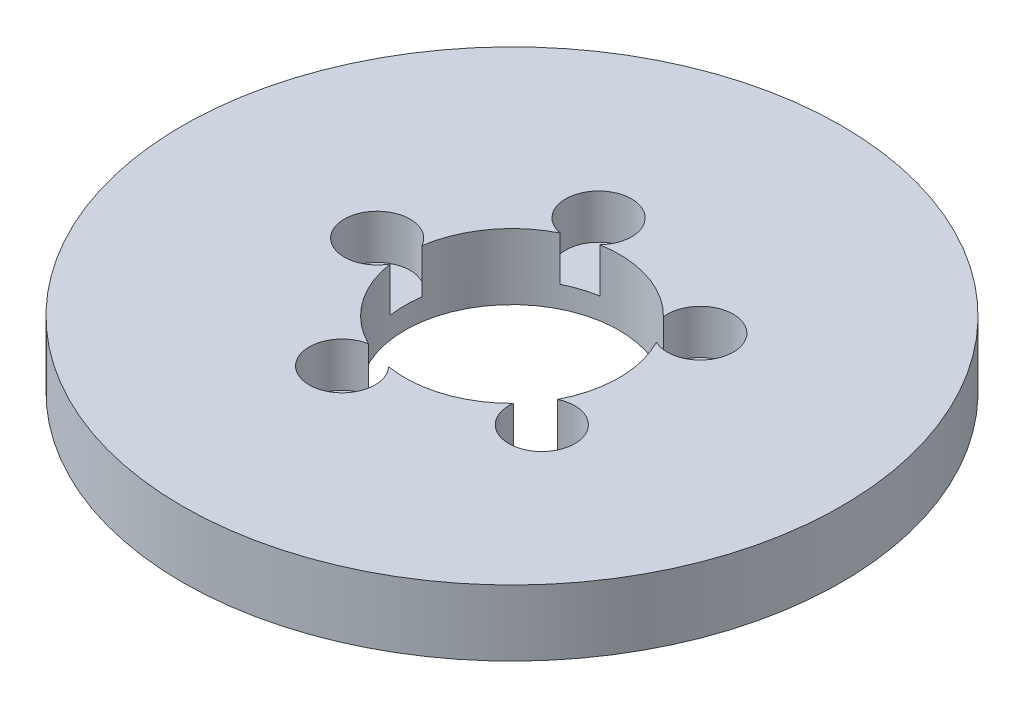
ISO-10303-21;
HEADER;
FILE_DESCRIPTION(('STEP AP214'),'2;1');
FILE_NAME('part.step','',(''),(''),'','','');
FILE_SCHEMA(('AUTOMOTIVE_DESIGN { 1 0 10303 214 1 1 1 1 }'));
ENDSEC;
DATA;
#1=APPLICATION_CONTEXT('core data for automotive mechanical design processes');
#2=APPLICATION_PROTOCOL_DEFINITION('international standard','automotive_design',2000,#1);
#3=PRODUCT_CONTEXT('',#1,'mechanical');
#4=PRODUCT('Part','Part','',(#3));
#5=PRODUCT_RELATED_PRODUCT_CATEGORY('part','',(#4));
#6=PRODUCT_DEFINITION_FORMATION('','',#4);
#7=PRODUCT_DEFINITION_CONTEXT('part definition',#1,'design');
#8=PRODUCT_DEFINITION('design','',#6,#7);
#9=PRODUCT_DEFINITION_SHAPE('','',#8);
#10=(LENGTH_UNIT() NAMED_UNIT(*) SI_UNIT(.MILLI.,.METRE.));
#11=(NAMED_UNIT(*) PLANE_ANGLE_UNIT() SI_UNIT($,.RADIAN.));
#12=(NAMED_UNIT(*) SI_UNIT($,.STERADIAN.) SOLID_ANGLE_UNIT());
#13=UNCERTAINTY_MEASURE_WITH_UNIT(LENGTH_MEASURE(1.E-05),#10,'distance_accuracy_value','');
#14=(GEOMETRIC_REPRESENTATION_CONTEXT(3) GLOBAL_UNCERTAINTY_ASSIGNED_CONTEXT((#13)) GLOBAL_UNIT_ASSIGNED_CONTEXT((#10,
#11,#12)) REPRESENTATION_CONTEXT('',''));
#15=CARTESIAN_POINT('',(0.,0.,0.));
#16=DIRECTION('',(0.,0.,1.));
#17=DIRECTION('',(1.,0.,0.));
#18=AXIS2_PLACEMENT_3D('',#15,#16,#17);
#19=CARTESIAN_POINT('',(0.,20.,0.));
#20=DIRECTION('',(0.,-1.,0.));
#21=DIRECTION('',(0.,0.,-1.));
#22=AXIS2_PLACEMENT_3D('',#19,#20,#21);
#23=CYLINDRICAL_SURFACE('',#22,100.);
#24=CARTESIAN_POINT('',(0.,20.,0.));
#25=DIRECTION('',(0.,1.,0.));
#26=DIRECTION('',(0.,0.,1.));
#27=AXIS2_PLACEMENT_3D('',#24,#25,#26);
#28=CIRCLE('',#27,100.);
#29=CARTESIAN_POINT('',(0.,20.,100.));
#30=VERTEX_POINT('',#29);
#31=EDGE_CURVE('E157',#30,#30,#28,.T.);
#32=ORIENTED_EDGE('',*,*,#31,.F.);
#33=EDGE_LOOP('',(#32));
#34=FACE_BOUND('',#33,.T.);
#35=CARTESIAN_POINT('',(0.,0.,0.));
#36=DIRECTION('',(0.,1.,0.));
#37=DIRECTION('',(0.,0.,1.));
#38=AXIS2_PLACEMENT_3D('',#35,#36,#37);
#39=CIRCLE('',#38,100.);
#40=CARTESIAN_POINT('',(0.,0.,100.));
#41=VERTEX_POINT('',#40);
#42=EDGE_CURVE('E150',#41,#41,#39,.T.);
#43=ORIENTED_EDGE('',*,*,#42,.T.);
#44=EDGE_LOOP('',(#43));
#45=FACE_BOUND('',#44,.T.);
#46=ADVANCED_FACE('F39',(#34,#45),#23,.T.);
#47=CARTESIAN_POINT('',(0.,20.,0.));
#48=DIRECTION('',(0.,1.,0.));
#49=DIRECTION('',(0.,0.,1.));
#50=AXIS2_PLACEMENT_3D('',#47,#48,#49);
#51=PLANE('',#50);
#52=CARTESIAN_POINT('',(-12.6431522409191,20.,-38.9116215098756));
#53=DIRECTION('',(0.,1.,0.));
#54=DIRECTION('',(-0.95105651629515,0.,0.309016994374958));
#55=AXIS2_PLACEMENT_3D('',#52,#53,#54);
#56=CIRCLE('',#55,10.);
#57=CARTESIAN_POINT('',(-5.36473831739823,20.,-32.0541663873176));
#58=VERTEX_POINT('',#57);
#59=CARTESIAN_POINT('',(-14.5008018078454,20.,-29.0856794132368));
#60=VERTEX_POINT('',#59);
#61=EDGE_CURVE('E194',#58,#60,#56,.T.);
#62=ORIENTED_EDGE('',*,*,#61,.F.);
#63=CARTESIAN_POINT('',(0.,20.,0.));
#64=DIRECTION('',(0.,1.,0.));
#65=DIRECTION('',(0.,0.,1.));
#66=AXIS2_PLACEMENT_3D('',#63,#64,#65);
#67=CIRCLE('',#66,32.5);
#68=CARTESIAN_POINT('',(23.1811307461435,20.,-22.7790512824876));
#69=VERTEX_POINT('',#68);
#70=EDGE_CURVE('E147',#69,#58,#67,.T.);
#71=ORIENTED_EDGE('',*,*,#70,.F.);
#72=CARTESIAN_POINT('',(33.1002022916642,20.,-24.048704650475));
#73=DIRECTION('',(0.,1.,0.));
#74=DIRECTION('',(-0.58778525229248,0.,-0.809016994374942));
#75=AXIS2_PLACEMENT_3D('',#72,#73,#74);
#76=CIRCLE('',#75,10.);
#77=CARTESIAN_POINT('',(28.827528506617,20.,-15.0074514891831));
#78=VERTEX_POINT('',#77);
#79=EDGE_CURVE('E254',#78,#69,#76,.T.);
#80=ORIENTED_EDGE('',*,*,#79,.F.);
#81=CARTESIAN_POINT('',(28.8275285066172,20.,15.0074514891827));
#82=VERTEX_POINT('',#81);
#83=EDGE_CURVE('E144',#82,#78,#67,.T.);
#84=ORIENTED_EDGE('',*,*,#83,.F.);
#85=CARTESIAN_POINT('',(33.1002022916646,20.,24.0487046504745));
#86=DIRECTION('',(0.,1.,0.));
#87=DIRECTION('',(0.587785252292469,0.,-0.809016994374951));
#88=AXIS2_PLACEMENT_3D('',#85,#86,#87);
#89=CIRCLE('',#88,10.);
#90=CARTESIAN_POINT('',(23.1811307461439,20.,22.7790512824872));
#91=VERTEX_POINT('',#90);
#92=EDGE_CURVE('E141',#91,#82,#89,.T.);
#93=ORIENTED_EDGE('',*,*,#92,.F.);
#94=CARTESIAN_POINT('',(-5.36473831739778,20.,32.0541663873176));
#95=VERTEX_POINT('',#94);
#96=EDGE_CURVE('E134',#95,#91,#67,.T.);
#97=ORIENTED_EDGE('',*,*,#96,.F.);
#98=CARTESIAN_POINT('',(-12.6431522409185,20.,38.9116215098758));
#99=DIRECTION('',(0.,1.,0.));
#100=DIRECTION('',(0.951056516295155,0.,0.309016994374945));
#101=AXIS2_PLACEMENT_3D('',#98,#99,#100);
#102=CIRCLE('',#101,10.);
#103=CARTESIAN_POINT('',(-14.500801807845,20.,29.085679413237));
#104=VERTEX_POINT('',#103);
#105=EDGE_CURVE('E111',#104,#95,#102,.T.);
#106=ORIENTED_EDGE('',*,*,#105,.F.);
#107=CARTESIAN_POINT('',(-32.1431191275179,20.,4.80311281922383));
#108=VERTEX_POINT('',#107);
#109=EDGE_CURVE('E145',#108,#104,#67,.T.);
#110=ORIENTED_EDGE('',*,*,#109,.F.);
#111=CARTESIAN_POINT('',(-40.9141001014916,20.,0.));
#112=DIRECTION('',(0.,1.,0.));
#113=DIRECTION('',(0.,0.,1.));
#114=AXIS2_PLACEMENT_3D('',#111,#112,#113);
#115=CIRCLE('',#114,10.);
#116=CARTESIAN_POINT('',(-32.1431191275179,20.,-4.80311281922383));
#117=VERTEX_POINT('',#116);
#118=EDGE_CURVE('E153',#117,#108,#115,.T.);
#119=ORIENTED_EDGE('',*,*,#118,.F.);
#120=EDGE_CURVE('E146',#60,#117,#67,.T.);
#121=ORIENTED_EDGE('',*,*,#120,.F.);
#122=EDGE_LOOP('',(#62,#71,#80,#84,#93,#97,#106,#110,#119,#121));
#123=FACE_BOUND('',#122,.T.);
#124=ORIENTED_EDGE('',*,*,#31,.T.);
#125=EDGE_LOOP('',(#124));
#126=FACE_BOUND('',#125,.T.);
#127=ADVANCED_FACE('F139',(#123,#126),#51,.T.);
#128=CARTESIAN_POINT('',(0.,0.,0.));
#129=DIRECTION('',(0.,1.,0.));
#130=DIRECTION('',(0.,0.,1.));
#131=AXIS2_PLACEMENT_3D('',#128,#129,#130);
#132=PLANE('',#131);
#133=CARTESIAN_POINT('',(0.,0.,0.));
#134=DIRECTION('',(0.,1.,0.));
#135=DIRECTION('',(0.,0.,1.));
#136=AXIS2_PLACEMENT_3D('',#133,#134,#135);
#137=CIRCLE('',#136,32.5);
#138=CARTESIAN_POINT('',(0.,0.,32.5));
#139=VERTEX_POINT('',#138);
#140=EDGE_CURVE('E154',#139,#139,#137,.T.);
#141=ORIENTED_EDGE('',*,*,#140,.T.);
#142=EDGE_LOOP('',(#141));
#143=FACE_BOUND('',#142,.T.);
#144=ORIENTED_EDGE('',*,*,#42,.F.);
#145=EDGE_LOOP('',(#144));
#146=FACE_BOUND('',#145,.T.);
#147=ADVANCED_FACE('F213',(#143,#146),#132,.F.);
#148=CARTESIAN_POINT('',(0.,20.,0.));
#149=DIRECTION('',(0.,-1.,0.));
#150=DIRECTION('',(0.,0.,-1.));
#151=AXIS2_PLACEMENT_3D('',#148,#149,#150);
#152=CYLINDRICAL_SURFACE('',#151,32.5);
#153=DIRECTION('',(0.,1.,0.));
#154=VECTOR('',#153,1.);
#155=CARTESIAN_POINT('',(-5.36473831739822,13.2630743548794,-32.0541663873176));
#156=LINE('',#155,#154);
#157=CARTESIAN_POINT('',(-5.36473831739823,6.52614870975883,-32.0541663873176));
#158=VERTEX_POINT('',#157);
#159=EDGE_CURVE('E11',#158,#58,#156,.T.);
#160=ORIENTED_EDGE('',*,*,#159,.F.);
#161=CARTESIAN_POINT('',(0.,6.52614870975883,0.));
#162=DIRECTION('',(0.,1.,0.));
#163=DIRECTION('',(0.,0.,1.));
#164=AXIS2_PLACEMENT_3D('',#161,#162,#163);
#165=CIRCLE('',#164,32.5);
#166=CARTESIAN_POINT('',(-14.5008018078454,6.52614870975883,-29.0856794132368));
#167=VERTEX_POINT('',#166);
#168=EDGE_CURVE('E189',#158,#167,#165,.T.);
#169=ORIENTED_EDGE('',*,*,#168,.T.);
#170=DIRECTION('',(0.,1.,0.));
#171=VECTOR('',#170,1.);
#172=CARTESIAN_POINT('',(-14.5008018078454,13.2630743548794,-29.0856794132368));
#173=LINE('',#172,#171);
#174=EDGE_CURVE('E46',#60,#167,#173,.F.);
#175=ORIENTED_EDGE('',*,*,#174,.F.);
#176=ORIENTED_EDGE('',*,*,#120,.T.);
#177=DIRECTION('',(0.,1.,0.));
#178=VECTOR('',#177,1.);
#179=CARTESIAN_POINT('',(-32.1431191275179,13.2630743548794,-4.80311281922383));
#180=LINE('',#179,#178);
#181=CARTESIAN_POINT('',(-32.1431191275179,6.52614870975883,-4.80311281922383));
#182=VERTEX_POINT('',#181);
#183=EDGE_CURVE('E168',#182,#117,#180,.T.);
#184=ORIENTED_EDGE('',*,*,#183,.F.);
#185=CARTESIAN_POINT('',(0.,6.52614870975883,0.));
#186=DIRECTION('',(0.,1.,0.));
#187=DIRECTION('',(0.,0.,1.));
#188=AXIS2_PLACEMENT_3D('',#185,#186,#187);
#189=CIRCLE('',#188,32.5);
#190=CARTESIAN_POINT('',(-32.1431191275179,6.52614870975883,4.80311281922383));
#191=VERTEX_POINT('',#190);
#192=EDGE_CURVE('E165',#182,#191,#189,.T.);
#193=ORIENTED_EDGE('',*,*,#192,.T.);
#194=DIRECTION('',(0.,1.,0.));
#195=VECTOR('',#194,1.);
#196=CARTESIAN_POINT('',(-32.1431191275179,13.2630743548794,4.80311281922383));
#197=LINE('',#196,#195);
#198=EDGE_CURVE('E170',#108,#191,#197,.F.);
#199=ORIENTED_EDGE('',*,*,#198,.F.);
#200=ORIENTED_EDGE('',*,*,#109,.T.);
#201=DIRECTION('',(0.,1.,0.));
#202=VECTOR('',#201,1.);
#203=CARTESIAN_POINT('',(-14.500801807845,13.2630743548794,29.085679413237));
#204=LINE('',#203,#202);
#205=CARTESIAN_POINT('',(-14.500801807845,6.52614870975883,29.085679413237));
#206=VERTEX_POINT('',#205);
#207=EDGE_CURVE('E121',#206,#104,#204,.T.);
#208=ORIENTED_EDGE('',*,*,#207,.F.);
#209=CARTESIAN_POINT('',(0.,6.52614870975883,0.));
#210=DIRECTION('',(0.,1.,0.));
#211=DIRECTION('',(0.,0.,1.));
#212=AXIS2_PLACEMENT_3D('',#209,#210,#211);
#213=CIRCLE('',#212,32.5);
#214=CARTESIAN_POINT('',(-5.36473831739778,6.52614870975883,32.0541663873176));
#215=VERTEX_POINT('',#214);
#216=EDGE_CURVE('E136',#206,#215,#213,.T.);
#217=ORIENTED_EDGE('',*,*,#216,.T.);
#218=DIRECTION('',(0.,1.,0.));
#219=VECTOR('',#218,1.);
#220=CARTESIAN_POINT('',(-5.36473831739777,13.2630743548794,32.0541663873177));
#221=LINE('',#220,#219);
#222=EDGE_CURVE('E117',#95,#215,#221,.F.);
#223=ORIENTED_EDGE('',*,*,#222,.F.);
#224=ORIENTED_EDGE('',*,*,#96,.T.);
#225=DIRECTION('',(0.,1.,0.));
#226=VECTOR('',#225,1.);
#227=CARTESIAN_POINT('',(23.1811307461439,13.2630743548794,22.7790512824872));
#228=LINE('',#227,#226);
#229=CARTESIAN_POINT('',(23.1811307461439,6.52614870975883,22.7790512824872));
#230=VERTEX_POINT('',#229);
#231=EDGE_CURVE('E182',#230,#91,#228,.T.);
#232=ORIENTED_EDGE('',*,*,#231,.F.);
#233=CARTESIAN_POINT('',(0.,6.52614870975883,0.));
#234=DIRECTION('',(0.,1.,0.));
#235=DIRECTION('',(0.,0.,1.));
#236=AXIS2_PLACEMENT_3D('',#233,#234,#235);
#237=CIRCLE('',#236,32.5);
#238=CARTESIAN_POINT('',(28.8275285066172,6.52614870975883,15.0074514891827));
#239=VERTEX_POINT('',#238);
#240=EDGE_CURVE('E174',#230,#239,#237,.T.);
#241=ORIENTED_EDGE('',*,*,#240,.T.);
#242=DIRECTION('',(0.,1.,0.));
#243=VECTOR('',#242,1.);
#244=CARTESIAN_POINT('',(28.8275285066172,13.2630743548794,15.0074514891827));
#245=LINE('',#244,#243);
#246=EDGE_CURVE('E177',#82,#239,#245,.F.);
#247=ORIENTED_EDGE('',*,*,#246,.F.);
#248=ORIENTED_EDGE('',*,*,#83,.T.);
#249=DIRECTION('',(0.,1.,0.));
#250=VECTOR('',#249,1.);
#251=CARTESIAN_POINT('',(28.827528506617,13.2630743548794,-15.0074514891831));
#252=LINE('',#251,#250);
#253=CARTESIAN_POINT('',(28.827528506617,6.52614870975883,-15.0074514891831));
#254=VERTEX_POINT('',#253);
#255=EDGE_CURVE('E187',#254,#78,#252,.T.);
#256=ORIENTED_EDGE('',*,*,#255,.F.);
#257=CARTESIAN_POINT('',(0.,6.52614870975883,0.));
#258=DIRECTION('',(0.,1.,0.));
#259=DIRECTION('',(0.,0.,1.));
#260=AXIS2_PLACEMENT_3D('',#257,#258,#259);
#261=CIRCLE('',#260,32.5);
#262=CARTESIAN_POINT('',(23.1811307461435,6.52614870975883,-22.7790512824876));
#263=VERTEX_POINT('',#262);
#264=EDGE_CURVE('E181',#254,#263,#261,.T.);
#265=ORIENTED_EDGE('',*,*,#264,.T.);
#266=DIRECTION('',(0.,1.,0.));
#267=VECTOR('',#266,1.);
#268=CARTESIAN_POINT('',(23.1811307461435,13.2630743548794,-22.7790512824876));
#269=LINE('',#268,#267);
#270=EDGE_CURVE('E186',#69,#263,#269,.F.);
#271=ORIENTED_EDGE('',*,*,#270,.F.);
#272=ORIENTED_EDGE('',*,*,#70,.T.);
#273=EDGE_LOOP('',(#160,#169,#175,#176,#184,#193,#199,#200,#208,#217,#223,#224,#232,#241,#247,
#248,#256,#265,#271,#272));
#274=FACE_BOUND('',#273,.T.);
#275=ORIENTED_EDGE('',*,*,#140,.F.);
#276=EDGE_LOOP('',(#275));
#277=FACE_BOUND('',#276,.T.);
#278=ADVANCED_FACE('F135',(#274,#277),#152,.F.);
#279=CARTESIAN_POINT('',(-40.9141001014916,6.52614870975883,0.));
#280=DIRECTION('',(0.,1.,0.));
#281=DIRECTION('',(0.,0.,1.));
#282=AXIS2_PLACEMENT_3D('',#279,#280,#281);
#283=CYLINDRICAL_SURFACE('',#282,10.);
#284=ORIENTED_EDGE('',*,*,#183,.T.);
#285=ORIENTED_EDGE('',*,*,#118,.T.);
#286=ORIENTED_EDGE('',*,*,#198,.T.);
#287=CARTESIAN_POINT('',(-40.9141001014916,6.52614870975883,0.));
#288=DIRECTION('',(0.,1.,0.));
#289=DIRECTION('',(0.,0.,1.));
#290=AXIS2_PLACEMENT_3D('',#287,#288,#289);
#291=CIRCLE('',#290,10.);
#292=EDGE_CURVE('E158',#182,#191,#291,.T.);
#293=ORIENTED_EDGE('',*,*,#292,.F.);
#294=EDGE_LOOP('',(#284,#285,#286,#293));
#295=FACE_BOUND('',#294,.T.);
#296=ADVANCED_FACE('F221',(#295),#283,.F.);
#297=CARTESIAN_POINT('',(-40.9141001014916,6.52614870975883,0.));
#298=DIRECTION('',(0.,1.,0.));
#299=DIRECTION('',(0.,0.,1.));
#300=AXIS2_PLACEMENT_3D('',#297,#298,#299);
#301=PLANE('',#300);
#302=ORIENTED_EDGE('',*,*,#292,.T.);
#303=ORIENTED_EDGE('',*,*,#192,.F.);
#304=EDGE_LOOP('',(#302,#303));
#305=FACE_BOUND('',#304,.T.);
#306=ADVANCED_FACE('F227',(#305),#301,.T.);
#307=CARTESIAN_POINT('',(-12.6431522409185,6.52614870975883,38.9116215098758));
#308=DIRECTION('',(0.,1.,0.));
#309=DIRECTION('',(0.,0.,1.));
#310=AXIS2_PLACEMENT_3D('',#307,#308,#309);
#311=CYLINDRICAL_SURFACE('',#310,10.);
#312=ORIENTED_EDGE('',*,*,#207,.T.);
#313=ORIENTED_EDGE('',*,*,#105,.T.);
#314=ORIENTED_EDGE('',*,*,#222,.T.);
#315=CARTESIAN_POINT('',(-12.6431522409185,6.52614870975883,38.9116215098758));
#316=DIRECTION('',(0.,1.,0.));
#317=DIRECTION('',(0.951056516295155,0.,0.309016994374945));
#318=AXIS2_PLACEMENT_3D('',#315,#316,#317);
#319=CIRCLE('',#318,10.);
#320=EDGE_CURVE('E127',#206,#215,#319,.T.);
#321=ORIENTED_EDGE('',*,*,#320,.F.);
#322=EDGE_LOOP('',(#312,#313,#314,#321));
#323=FACE_BOUND('',#322,.T.);
#324=ADVANCED_FACE('F116',(#323),#311,.F.);
#325=CARTESIAN_POINT('',(-12.6431522409185,6.52614870975883,38.9116215098758));
#326=DIRECTION('',(0.,1.,0.));
#327=DIRECTION('',(0.951056516295155,0.,0.309016994374945));
#328=AXIS2_PLACEMENT_3D('',#325,#326,#327);
#329=PLANE('',#328);
#330=ORIENTED_EDGE('',*,*,#320,.T.);
#331=ORIENTED_EDGE('',*,*,#216,.F.);
#332=EDGE_LOOP('',(#330,#331));
#333=FACE_BOUND('',#332,.T.);
#334=ADVANCED_FACE('F234',(#333),#329,.T.);
#335=CARTESIAN_POINT('',(33.1002022916646,6.52614870975883,24.0487046504745));
#336=DIRECTION('',(0.,1.,0.));
#337=DIRECTION('',(0.,0.,1.));
#338=AXIS2_PLACEMENT_3D('',#335,#336,#337);
#339=CYLINDRICAL_SURFACE('',#338,10.);
#340=ORIENTED_EDGE('',*,*,#231,.T.);
#341=ORIENTED_EDGE('',*,*,#92,.T.);
#342=ORIENTED_EDGE('',*,*,#246,.T.);
#343=CARTESIAN_POINT('',(33.1002022916646,6.52614870975883,24.0487046504745));
#344=DIRECTION('',(0.,1.,0.));
#345=DIRECTION('',(0.587785252292469,0.,-0.809016994374951));
#346=AXIS2_PLACEMENT_3D('',#343,#344,#345);
#347=CIRCLE('',#346,10.);
#348=EDGE_CURVE('E130',#230,#239,#347,.T.);
#349=ORIENTED_EDGE('',*,*,#348,.F.);
#350=EDGE_LOOP('',(#340,#341,#342,#349));
#351=FACE_BOUND('',#350,.T.);
#352=ADVANCED_FACE('F240',(#351),#339,.F.);
#353=CARTESIAN_POINT('',(33.1002022916646,6.52614870975883,24.0487046504745));
#354=DIRECTION('',(0.,1.,0.));
#355=DIRECTION('',(0.587785252292469,0.,-0.809016994374951));
#356=AXIS2_PLACEMENT_3D('',#353,#354,#355);
#357=PLANE('',#356);
#358=ORIENTED_EDGE('',*,*,#348,.T.);
#359=ORIENTED_EDGE('',*,*,#240,.F.);
#360=EDGE_LOOP('',(#358,#359));
#361=FACE_BOUND('',#360,.T.);
#362=ADVANCED_FACE('F245',(#361),#357,.T.);
#363=CARTESIAN_POINT('',(33.1002022916642,6.52614870975883,-24.048704650475));
#364=DIRECTION('',(0.,1.,0.));
#365=DIRECTION('',(0.,0.,1.));
#366=AXIS2_PLACEMENT_3D('',#363,#364,#365);
#367=CYLINDRICAL_SURFACE('',#366,10.);
#368=ORIENTED_EDGE('',*,*,#255,.T.);
#369=ORIENTED_EDGE('',*,*,#79,.T.);
#370=ORIENTED_EDGE('',*,*,#270,.T.);
#371=CARTESIAN_POINT('',(33.1002022916642,6.52614870975883,-24.048704650475));
#372=DIRECTION('',(0.,1.,0.));
#373=DIRECTION('',(-0.58778525229248,0.,-0.809016994374942));
#374=AXIS2_PLACEMENT_3D('',#371,#372,#373);
#375=CIRCLE('',#374,10.);
#376=EDGE_CURVE('E56',#254,#263,#375,.T.);
#377=ORIENTED_EDGE('',*,*,#376,.F.);
#378=EDGE_LOOP('',(#368,#369,#370,#377));
#379=FACE_BOUND('',#378,.T.);
#380=ADVANCED_FACE('F266',(#379),#367,.F.);
#381=CARTESIAN_POINT('',(33.1002022916642,6.52614870975883,-24.048704650475));
#382=DIRECTION('',(0.,1.,0.));
#383=DIRECTION('',(-0.58778525229248,0.,-0.809016994374942));
#384=AXIS2_PLACEMENT_3D('',#381,#382,#383);
#385=PLANE('',#384);
#386=ORIENTED_EDGE('',*,*,#376,.T.);
#387=ORIENTED_EDGE('',*,*,#264,.F.);
#388=EDGE_LOOP('',(#386,#387));
#389=FACE_BOUND('',#388,.T.);
#390=ADVANCED_FACE('F204',(#389),#385,.T.);
#391=CARTESIAN_POINT('',(-12.6431522409191,6.52614870975883,-38.9116215098756));
#392=DIRECTION('',(0.,1.,0.));
#393=DIRECTION('',(0.,0.,1.));
#394=AXIS2_PLACEMENT_3D('',#391,#392,#393);
#395=CYLINDRICAL_SURFACE('',#394,10.);
#396=ORIENTED_EDGE('',*,*,#159,.T.);
#397=ORIENTED_EDGE('',*,*,#61,.T.);
#398=ORIENTED_EDGE('',*,*,#174,.T.);
#399=CARTESIAN_POINT('',(-12.6431522409191,6.52614870975883,-38.9116215098756));
#400=DIRECTION('',(0.,1.,0.));
#401=DIRECTION('',(-0.95105651629515,0.,0.309016994374958));
#402=AXIS2_PLACEMENT_3D('',#399,#400,#401);
#403=CIRCLE('',#402,10.);
#404=EDGE_CURVE('E55',#158,#167,#403,.T.);
#405=ORIENTED_EDGE('',*,*,#404,.F.);
#406=EDGE_LOOP('',(#396,#397,#398,#405));
#407=FACE_BOUND('',#406,.T.);
#408=ADVANCED_FACE('F193',(#407),#395,.F.);
#409=CARTESIAN_POINT('',(-12.6431522409191,6.52614870975883,-38.9116215098756));
#410=DIRECTION('',(0.,1.,0.));
#411=DIRECTION('',(-0.95105651629515,0.,0.309016994374958));
#412=AXIS2_PLACEMENT_3D('',#409,#410,#411);
#413=PLANE('',#412);
#414=ORIENTED_EDGE('',*,*,#404,.T.);
#415=ORIENTED_EDGE('',*,*,#168,.F.);
#416=EDGE_LOOP('',(#414,#415));
#417=FACE_BOUND('',#416,.T.);
#418=ADVANCED_FACE('F196',(#417),#413,.T.);
#419=CLOSED_SHELL('',(#46,#127,#147,#278,#296,#306,#324,#334,#352,#362,#380,#390,#408,#418));
#420=MANIFOLD_SOLID_BREP('B2',#419);
#421=ADVANCED_BREP_SHAPE_REPRESENTATION('',(#18,#420),#14);
#422=SHAPE_DEFINITION_REPRESENTATION(#9,#421);
ENDSEC;
END-ISO-10303-21;
